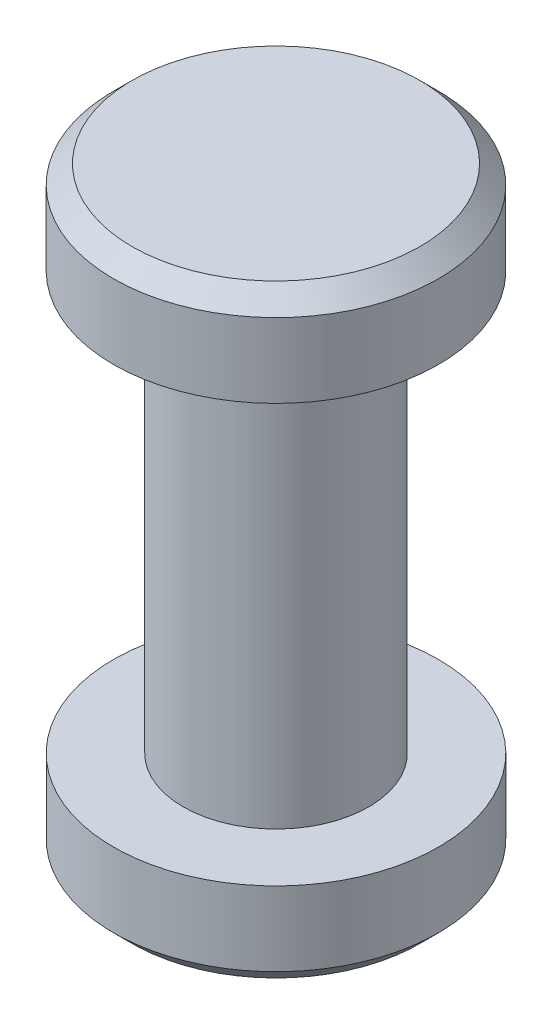
ISO-10303-21;
HEADER;
FILE_DESCRIPTION(('STEP AP214'),'2;1');
FILE_NAME('part.step','',(''),(''),'','','');
FILE_SCHEMA(('AUTOMOTIVE_DESIGN { 1 0 10303 214 1 1 1 1 }'));
ENDSEC;
DATA;
#1=APPLICATION_CONTEXT('core data for automotive mechanical design processes');
#2=APPLICATION_PROTOCOL_DEFINITION('international standard','automotive_design',2000,#1);
#3=PRODUCT_CONTEXT('',#1,'mechanical');
#4=PRODUCT('Part','Part','',(#3));
#5=PRODUCT_RELATED_PRODUCT_CATEGORY('part','',(#4));
#6=PRODUCT_DEFINITION_FORMATION('','',#4);
#7=PRODUCT_DEFINITION_CONTEXT('part definition',#1,'design');
#8=PRODUCT_DEFINITION('design','',#6,#7);
#9=PRODUCT_DEFINITION_SHAPE('','',#8);
#10=(LENGTH_UNIT() NAMED_UNIT(*) SI_UNIT(.MILLI.,.METRE.));
#11=(NAMED_UNIT(*) PLANE_ANGLE_UNIT() SI_UNIT($,.RADIAN.));
#12=(NAMED_UNIT(*) SI_UNIT($,.STERADIAN.) SOLID_ANGLE_UNIT());
#13=UNCERTAINTY_MEASURE_WITH_UNIT(LENGTH_MEASURE(1.E-05),#10,'distance_accuracy_value','');
#14=(GEOMETRIC_REPRESENTATION_CONTEXT(3) GLOBAL_UNCERTAINTY_ASSIGNED_CONTEXT((#13)) GLOBAL_UNIT_ASSIGNED_CONTEXT((#10,
#11,#12)) REPRESENTATION_CONTEXT('',''));
#15=CARTESIAN_POINT('',(0.,0.,0.));
#16=DIRECTION('',(0.,0.,1.));
#17=DIRECTION('',(1.,0.,0.));
#18=AXIS2_PLACEMENT_3D('',#15,#16,#17);
#19=CARTESIAN_POINT('',(0.,4.5,0.));
#20=DIRECTION('',(0.,-1.,0.));
#21=DIRECTION('',(0.,0.,-1.));
#22=AXIS2_PLACEMENT_3D('',#19,#20,#21);
#23=CYLINDRICAL_SURFACE('',#22,1.);
#24=CARTESIAN_POINT('',(0.,4.5,0.));
#25=DIRECTION('',(0.,1.,0.));
#26=DIRECTION('',(0.,0.,1.));
#27=AXIS2_PLACEMENT_3D('',#24,#25,#26);
#28=CIRCLE('',#27,1.);
#29=CARTESIAN_POINT('',(0.,4.5,1.));
#30=VERTEX_POINT('',#29);
#31=EDGE_CURVE('E64',#30,#30,#28,.T.);
#32=ORIENTED_EDGE('',*,*,#31,.F.);
#33=EDGE_LOOP('',(#32));
#34=FACE_BOUND('',#33,.T.);
#35=CARTESIAN_POINT('',(0.,0.,0.));
#36=DIRECTION('',(0.,1.,0.));
#37=DIRECTION('',(0.,0.,1.));
#38=AXIS2_PLACEMENT_3D('',#35,#36,#37);
#39=CIRCLE('',#38,1.);
#40=CARTESIAN_POINT('',(0.,0.,1.));
#41=VERTEX_POINT('',#40);
#42=EDGE_CURVE('E65',#41,#41,#39,.T.);
#43=ORIENTED_EDGE('',*,*,#42,.T.);
#44=EDGE_LOOP('',(#43));
#45=FACE_BOUND('',#44,.T.);
#46=ADVANCED_FACE('F39',(#34,#45),#23,.T.);
#47=CARTESIAN_POINT('',(0.,5.5,0.));
#48=DIRECTION('',(0.,-1.,0.));
#49=DIRECTION('',(0.,0.,-1.));
#50=AXIS2_PLACEMENT_3D('',#47,#48,#49);
#51=CYLINDRICAL_SURFACE('',#50,1.75);
#52=CARTESIAN_POINT('',(0.,5.3,0.));
#53=DIRECTION('',(0.,1.,0.));
#54=DIRECTION('',(0.,0.,1.));
#55=AXIS2_PLACEMENT_3D('',#52,#53,#54);
#56=CIRCLE('',#55,1.75);
#57=CARTESIAN_POINT('',(0.,5.3,1.75));
#58=VERTEX_POINT('',#57);
#59=EDGE_CURVE('E53',#58,#58,#56,.F.);
#60=ORIENTED_EDGE('',*,*,#59,.T.);
#61=EDGE_LOOP('',(#60));
#62=FACE_BOUND('',#61,.T.);
#63=CARTESIAN_POINT('',(0.,4.5,0.));
#64=DIRECTION('',(0.,1.,0.));
#65=DIRECTION('',(0.,0.,1.));
#66=AXIS2_PLACEMENT_3D('',#63,#64,#65);
#67=CIRCLE('',#66,1.75);
#68=CARTESIAN_POINT('',(0.,4.5,1.75));
#69=VERTEX_POINT('',#68);
#70=EDGE_CURVE('E69',#69,#69,#67,.T.);
#71=ORIENTED_EDGE('',*,*,#70,.T.);
#72=EDGE_LOOP('',(#71));
#73=FACE_BOUND('',#72,.T.);
#74=ADVANCED_FACE('F97',(#62,#73),#51,.T.);
#75=CARTESIAN_POINT('',(0.,5.5,0.));
#76=DIRECTION('',(0.,1.,0.));
#77=DIRECTION('',(0.,0.,1.));
#78=AXIS2_PLACEMENT_3D('',#75,#76,#77);
#79=PLANE('',#78);
#80=CARTESIAN_POINT('',(0.,5.5,0.));
#81=DIRECTION('',(0.,1.,0.));
#82=DIRECTION('',(0.,0.,1.));
#83=AXIS2_PLACEMENT_3D('',#80,#81,#82);
#84=CIRCLE('',#83,1.55);
#85=CARTESIAN_POINT('',(0.,5.5,1.55));
#86=VERTEX_POINT('',#85);
#87=EDGE_CURVE('E58',#86,#86,#84,.T.);
#88=ORIENTED_EDGE('',*,*,#87,.T.);
#89=EDGE_LOOP('',(#88));
#90=FACE_BOUND('',#89,.T.);
#91=ADVANCED_FACE('F103',(#90),#79,.T.);
#92=CARTESIAN_POINT('',(0.,4.5,0.));
#93=DIRECTION('',(0.,1.,0.));
#94=DIRECTION('',(0.,0.,1.));
#95=AXIS2_PLACEMENT_3D('',#92,#93,#94);
#96=PLANE('',#95);
#97=ORIENTED_EDGE('',*,*,#31,.T.);
#98=EDGE_LOOP('',(#97));
#99=FACE_BOUND('',#98,.T.);
#100=ORIENTED_EDGE('',*,*,#70,.F.);
#101=EDGE_LOOP('',(#100));
#102=FACE_BOUND('',#101,.T.);
#103=ADVANCED_FACE('F114',(#99,#102),#96,.F.);
#104=CARTESIAN_POINT('',(0.,5.5,0.));
#105=DIRECTION('',(0.,-1.,0.));
#106=DIRECTION('',(0.,0.,-1.));
#107=AXIS2_PLACEMENT_3D('',#104,#105,#106);
#108=CONICAL_SURFACE('',#107,1.55,0.785398163397447);
#109=ORIENTED_EDGE('',*,*,#59,.F.);
#110=EDGE_LOOP('',(#109));
#111=FACE_BOUND('',#110,.T.);
#112=ORIENTED_EDGE('',*,*,#87,.F.);
#113=EDGE_LOOP('',(#112));
#114=FACE_BOUND('',#113,.T.);
#115=ADVANCED_FACE('F110',(#111,#114),#108,.T.);
#116=CARTESIAN_POINT('',(0.,-1.,0.));
#117=DIRECTION('',(0.,1.,0.));
#118=DIRECTION('',(0.,0.,1.));
#119=AXIS2_PLACEMENT_3D('',#116,#117,#118);
#120=CYLINDRICAL_SURFACE('',#119,1.75);
#121=CARTESIAN_POINT('',(0.,-0.8,0.));
#122=DIRECTION('',(0.,-1.,0.));
#123=DIRECTION('',(0.,0.,-1.));
#124=AXIS2_PLACEMENT_3D('',#121,#122,#123);
#125=CIRCLE('',#124,1.75);
#126=CARTESIAN_POINT('',(0.,-0.8,-1.75));
#127=VERTEX_POINT('',#126);
#128=EDGE_CURVE('E10',#127,#127,#125,.F.);
#129=ORIENTED_EDGE('',*,*,#128,.T.);
#130=EDGE_LOOP('',(#129));
#131=FACE_BOUND('',#130,.T.);
#132=CARTESIAN_POINT('',(0.,0.,0.));
#133=DIRECTION('',(0.,-1.,0.));
#134=DIRECTION('',(0.,0.,-1.));
#135=AXIS2_PLACEMENT_3D('',#132,#133,#134);
#136=CIRCLE('',#135,1.75);
#137=CARTESIAN_POINT('',(0.,0.,-1.75));
#138=VERTEX_POINT('',#137);
#139=EDGE_CURVE('E70',#138,#138,#136,.T.);
#140=ORIENTED_EDGE('',*,*,#139,.T.);
#141=EDGE_LOOP('',(#140));
#142=FACE_BOUND('',#141,.T.);
#143=ADVANCED_FACE('F81',(#131,#142),#120,.T.);
#144=CARTESIAN_POINT('',(0.,-1.,0.));
#145=DIRECTION('',(0.,-1.,0.));
#146=DIRECTION('',(0.,0.,-1.));
#147=AXIS2_PLACEMENT_3D('',#144,#145,#146);
#148=PLANE('',#147);
#149=CARTESIAN_POINT('',(0.,-1.,0.));
#150=DIRECTION('',(0.,-1.,0.));
#151=DIRECTION('',(0.,0.,-1.));
#152=AXIS2_PLACEMENT_3D('',#149,#150,#151);
#153=CIRCLE('',#152,1.55);
#154=CARTESIAN_POINT('',(0.,-1.,-1.55));
#155=VERTEX_POINT('',#154);
#156=EDGE_CURVE('E48',#155,#155,#153,.T.);
#157=ORIENTED_EDGE('',*,*,#156,.T.);
#158=EDGE_LOOP('',(#157));
#159=FACE_BOUND('',#158,.T.);
#160=ADVANCED_FACE('F85',(#159),#148,.T.);
#161=CARTESIAN_POINT('',(0.,0.,0.));
#162=DIRECTION('',(0.,-1.,0.));
#163=DIRECTION('',(0.,0.,-1.));
#164=AXIS2_PLACEMENT_3D('',#161,#162,#163);
#165=PLANE('',#164);
#166=ORIENTED_EDGE('',*,*,#42,.F.);
#167=EDGE_LOOP('',(#166));
#168=FACE_BOUND('',#167,.T.);
#169=ORIENTED_EDGE('',*,*,#139,.F.);
#170=EDGE_LOOP('',(#169));
#171=FACE_BOUND('',#170,.T.);
#172=ADVANCED_FACE('F83',(#168,#171),#165,.F.);
#173=CARTESIAN_POINT('',(0.,-1.,0.));
#174=DIRECTION('',(0.,1.,0.));
#175=DIRECTION('',(0.,0.,1.));
#176=AXIS2_PLACEMENT_3D('',#173,#174,#175);
#177=CONICAL_SURFACE('',#176,1.55,0.785398163397446);
#178=ORIENTED_EDGE('',*,*,#128,.F.);
#179=EDGE_LOOP('',(#178));
#180=FACE_BOUND('',#179,.T.);
#181=ORIENTED_EDGE('',*,*,#156,.F.);
#182=EDGE_LOOP('',(#181));
#183=FACE_BOUND('',#182,.T.);
#184=ADVANCED_FACE('F42',(#180,#183),#177,.T.);
#185=CLOSED_SHELL('',(#46,#74,#91,#103,#115,#143,#160,#172,#184));
#186=MANIFOLD_SOLID_BREP('B2',#185);
#187=ADVANCED_BREP_SHAPE_REPRESENTATION('',(#18,#186),#14);
#188=SHAPE_DEFINITION_REPRESENTATION(#9,#187);
ENDSEC;
END-ISO-10303-21;
